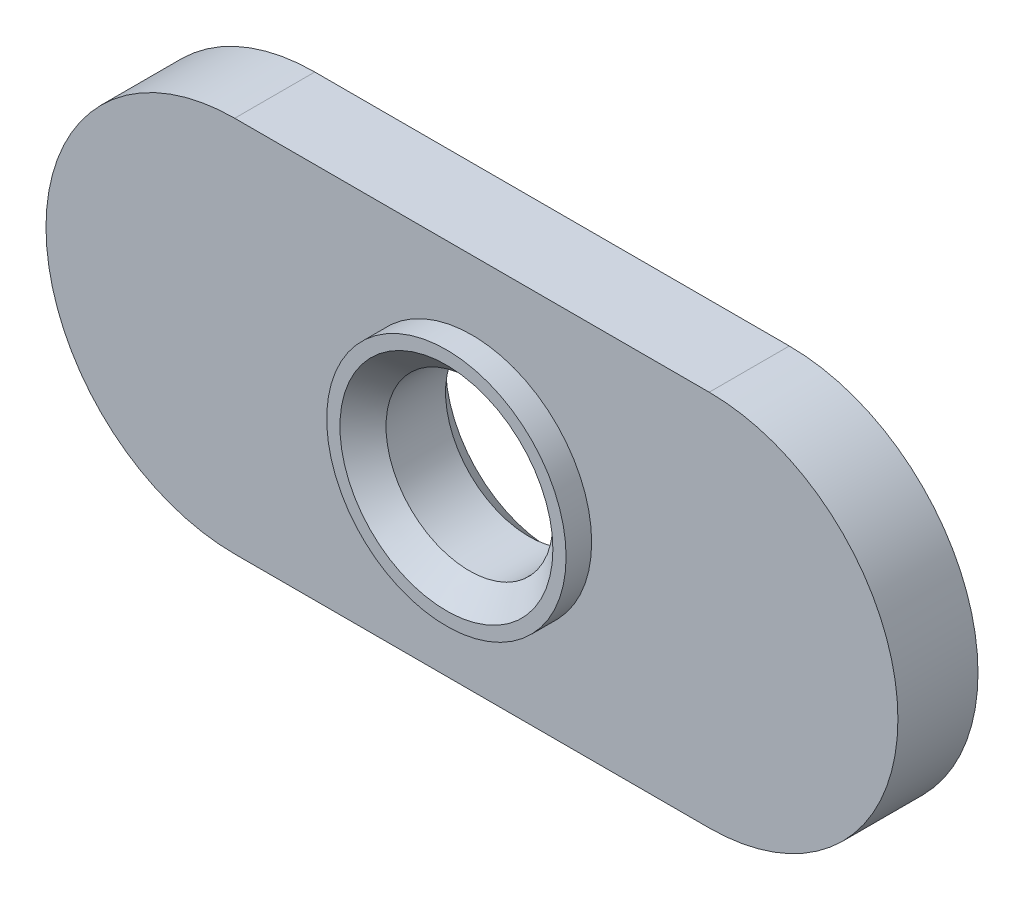
ISO-10303-21;
HEADER;
FILE_DESCRIPTION(('STEP AP214'),'2;1');
FILE_NAME('part.step','',(''),(''),'','','');
FILE_SCHEMA(('AUTOMOTIVE_DESIGN { 1 0 10303 214 1 1 1 1 }'));
ENDSEC;
DATA;
#1=APPLICATION_CONTEXT('core data for automotive mechanical design processes');
#2=APPLICATION_PROTOCOL_DEFINITION('international standard','automotive_design',2000,#1);
#3=PRODUCT_CONTEXT('',#1,'mechanical');
#4=PRODUCT('Part','Part','',(#3));
#5=PRODUCT_RELATED_PRODUCT_CATEGORY('part','',(#4));
#6=PRODUCT_DEFINITION_FORMATION('','',#4);
#7=PRODUCT_DEFINITION_CONTEXT('part definition',#1,'design');
#8=PRODUCT_DEFINITION('design','',#6,#7);
#9=PRODUCT_DEFINITION_SHAPE('','',#8);
#10=(LENGTH_UNIT() NAMED_UNIT(*) SI_UNIT(.MILLI.,.METRE.));
#11=(NAMED_UNIT(*) PLANE_ANGLE_UNIT() SI_UNIT($,.RADIAN.));
#12=(NAMED_UNIT(*) SI_UNIT($,.STERADIAN.) SOLID_ANGLE_UNIT());
#13=UNCERTAINTY_MEASURE_WITH_UNIT(LENGTH_MEASURE(1.E-05),#10,'distance_accuracy_value','');
#14=(GEOMETRIC_REPRESENTATION_CONTEXT(3) GLOBAL_UNCERTAINTY_ASSIGNED_CONTEXT((#13)) GLOBAL_UNIT_ASSIGNED_CONTEXT((#10,
#11,#12)) REPRESENTATION_CONTEXT('',''));
#15=CARTESIAN_POINT('',(0.,0.,0.));
#16=DIRECTION('',(0.,0.,1.));
#17=DIRECTION('',(1.,0.,0.));
#18=AXIS2_PLACEMENT_3D('',#15,#16,#17);
#19=CARTESIAN_POINT('',(-7.0739,0.,-1.1938));
#20=DIRECTION('',(0.,0.,1.));
#21=DIRECTION('',(1.,0.,0.));
#22=AXIS2_PLACEMENT_3D('',#19,#20,#21);
#23=PLANE('',#22);
#24=CARTESIAN_POINT('',(-7.0739,0.,-1.1938));
#25=DIRECTION('',(0.,0.,1.));
#26=DIRECTION('',(1.,0.,0.));
#27=AXIS2_PLACEMENT_3D('',#24,#25,#26);
#28=CIRCLE('',#27,5.6261);
#29=CARTESIAN_POINT('',(-7.0739,5.6261,-1.1938));
#30=VERTEX_POINT('',#29);
#31=CARTESIAN_POINT('',(-7.0739,-5.6261,-1.1938));
#32=VERTEX_POINT('',#31);
#33=EDGE_CURVE('E88',#30,#32,#28,.T.);
#34=ORIENTED_EDGE('',*,*,#33,.F.);
#35=DIRECTION('',(-1.,0.,0.));
#36=VECTOR('',#35,1.);
#37=CARTESIAN_POINT('',(7.0739,5.6261,-1.1938));
#38=LINE('',#37,#36);
#39=CARTESIAN_POINT('',(7.0739,5.6261,-1.1938));
#40=VERTEX_POINT('',#39);
#41=EDGE_CURVE('E101',#40,#30,#38,.T.);
#42=ORIENTED_EDGE('',*,*,#41,.F.);
#43=CARTESIAN_POINT('',(7.0739,0.,-1.1938));
#44=DIRECTION('',(0.,0.,1.));
#45=DIRECTION('',(1.,0.,0.));
#46=AXIS2_PLACEMENT_3D('',#43,#44,#45);
#47=CIRCLE('',#46,5.6261);
#48=CARTESIAN_POINT('',(7.0739,-5.6261,-1.1938));
#49=VERTEX_POINT('',#48);
#50=EDGE_CURVE('E91',#49,#40,#47,.T.);
#51=ORIENTED_EDGE('',*,*,#50,.F.);
#52=DIRECTION('',(1.,0.,0.));
#53=VECTOR('',#52,1.);
#54=CARTESIAN_POINT('',(-7.0739,-5.6261,-1.1938));
#55=LINE('',#54,#53);
#56=EDGE_CURVE('E78',#32,#49,#55,.T.);
#57=ORIENTED_EDGE('',*,*,#56,.F.);
#58=EDGE_LOOP('',(#34,#42,#51,#57));
#59=FACE_BOUND('',#58,.T.);
#60=CARTESIAN_POINT('',(0.,0.,-1.1938));
#61=DIRECTION('',(0.,0.,1.));
#62=DIRECTION('',(1.,0.,0.));
#63=AXIS2_PLACEMENT_3D('',#60,#61,#62);
#64=CIRCLE('',#63,3.175);
#65=CARTESIAN_POINT('',(3.175,0.,-1.1938));
#66=VERTEX_POINT('',#65);
#67=EDGE_CURVE('E141',#66,#66,#64,.T.);
#68=ORIENTED_EDGE('',*,*,#67,.T.);
#69=EDGE_LOOP('',(#68));
#70=FACE_BOUND('',#69,.T.);
#71=ADVANCED_FACE('F34',(#59,#70),#23,.F.);
#72=CARTESIAN_POINT('',(0.,0.,1.9558));
#73=DIRECTION('',(0.,0.,1.));
#74=DIRECTION('',(1.,0.,0.));
#75=AXIS2_PLACEMENT_3D('',#72,#73,#74);
#76=PLANE('',#75);
#77=CARTESIAN_POINT('',(0.,0.,1.9558));
#78=DIRECTION('',(0.,0.,1.));
#79=DIRECTION('',(1.,0.,0.));
#80=AXIS2_PLACEMENT_3D('',#77,#78,#79);
#81=CIRCLE('',#80,3.5687);
#82=CARTESIAN_POINT('',(3.5687,0.,1.9558));
#83=VERTEX_POINT('',#82);
#84=EDGE_CURVE('E96',#83,#83,#81,.T.);
#85=ORIENTED_EDGE('',*,*,#84,.T.);
#86=EDGE_LOOP('',(#85));
#87=FACE_BOUND('',#86,.T.);
#88=CARTESIAN_POINT('',(0.,0.,1.9558));
#89=DIRECTION('',(0.,0.,1.));
#90=DIRECTION('',(1.,0.,0.));
#91=AXIS2_PLACEMENT_3D('',#88,#89,#90);
#92=CIRCLE('',#91,3.175);
#93=CARTESIAN_POINT('',(3.175,0.,1.9558));
#94=VERTEX_POINT('',#93);
#95=EDGE_CURVE('E130',#94,#94,#92,.T.);
#96=ORIENTED_EDGE('',*,*,#95,.F.);
#97=EDGE_LOOP('',(#96));
#98=FACE_BOUND('',#97,.T.);
#99=ADVANCED_FACE('F118',(#87,#98),#76,.T.);
#100=CARTESIAN_POINT('',(-7.0739,0.,1.1938));
#101=DIRECTION('',(0.,0.,1.));
#102=DIRECTION('',(1.,0.,0.));
#103=AXIS2_PLACEMENT_3D('',#100,#101,#102);
#104=PLANE('',#103);
#105=CARTESIAN_POINT('',(-7.0739,0.,1.1938));
#106=DIRECTION('',(0.,0.,1.));
#107=DIRECTION('',(1.,0.,0.));
#108=AXIS2_PLACEMENT_3D('',#105,#106,#107);
#109=CIRCLE('',#108,5.6261);
#110=CARTESIAN_POINT('',(-7.0739,5.6261,1.1938));
#111=VERTEX_POINT('',#110);
#112=CARTESIAN_POINT('',(-7.0739,-5.6261,1.1938));
#113=VERTEX_POINT('',#112);
#114=EDGE_CURVE('E103',#111,#113,#109,.T.);
#115=ORIENTED_EDGE('',*,*,#114,.T.);
#116=DIRECTION('',(1.,0.,0.));
#117=VECTOR('',#116,1.);
#118=CARTESIAN_POINT('',(-7.0739,-5.6261,1.1938));
#119=LINE('',#118,#117);
#120=CARTESIAN_POINT('',(7.0739,-5.6261,1.1938));
#121=VERTEX_POINT('',#120);
#122=EDGE_CURVE('E79',#113,#121,#119,.T.);
#123=ORIENTED_EDGE('',*,*,#122,.T.);
#124=CARTESIAN_POINT('',(7.0739,0.,1.1938));
#125=DIRECTION('',(0.,0.,1.));
#126=DIRECTION('',(1.,0.,0.));
#127=AXIS2_PLACEMENT_3D('',#124,#125,#126);
#128=CIRCLE('',#127,5.6261);
#129=CARTESIAN_POINT('',(7.0739,5.6261,1.1938));
#130=VERTEX_POINT('',#129);
#131=EDGE_CURVE('E55',#121,#130,#128,.T.);
#132=ORIENTED_EDGE('',*,*,#131,.T.);
#133=DIRECTION('',(-1.,0.,0.));
#134=VECTOR('',#133,1.);
#135=CARTESIAN_POINT('',(7.0739,5.6261,1.1938));
#136=LINE('',#135,#134);
#137=EDGE_CURVE('E50',#130,#111,#136,.T.);
#138=ORIENTED_EDGE('',*,*,#137,.T.);
#139=EDGE_LOOP('',(#115,#123,#132,#138));
#140=FACE_BOUND('',#139,.T.);
#141=CARTESIAN_POINT('',(0.,0.,1.1938));
#142=DIRECTION('',(0.,0.,1.));
#143=DIRECTION('',(1.,0.,0.));
#144=AXIS2_PLACEMENT_3D('',#141,#142,#143);
#145=CIRCLE('',#144,3.5687);
#146=CARTESIAN_POINT('',(3.5687,0.,1.1938));
#147=VERTEX_POINT('',#146);
#148=EDGE_CURVE('E38',#147,#147,#145,.F.);
#149=ORIENTED_EDGE('',*,*,#148,.T.);
#150=EDGE_LOOP('',(#149));
#151=FACE_BOUND('',#150,.T.);
#152=ADVANCED_FACE('F115',(#140,#151),#104,.T.);
#153=CARTESIAN_POINT('',(-7.0739,0.,1.1938));
#154=DIRECTION('',(0.,0.,-1.));
#155=DIRECTION('',(-1.,0.,0.));
#156=AXIS2_PLACEMENT_3D('',#153,#154,#155);
#157=CYLINDRICAL_SURFACE('',#156,5.6261);
#158=DIRECTION('',(0.,0.,-1.));
#159=VECTOR('',#158,1.);
#160=CARTESIAN_POINT('',(-7.0739,5.6261,1.1938));
#161=LINE('',#160,#159);
#162=EDGE_CURVE('E93',#111,#30,#161,.T.);
#163=ORIENTED_EDGE('',*,*,#162,.T.);
#164=ORIENTED_EDGE('',*,*,#33,.T.);
#165=DIRECTION('',(0.,0.,-1.));
#166=VECTOR('',#165,1.);
#167=CARTESIAN_POINT('',(-7.0739,-5.6261,1.1938));
#168=LINE('',#167,#166);
#169=EDGE_CURVE('E11',#113,#32,#168,.T.);
#170=ORIENTED_EDGE('',*,*,#169,.F.);
#171=ORIENTED_EDGE('',*,*,#114,.F.);
#172=EDGE_LOOP('',(#163,#164,#170,#171));
#173=FACE_BOUND('',#172,.T.);
#174=ADVANCED_FACE('F36',(#173),#157,.T.);
#175=CARTESIAN_POINT('',(-7.0739,-5.6261,1.1938));
#176=DIRECTION('',(0.,1.,0.));
#177=DIRECTION('',(0.,0.,1.));
#178=AXIS2_PLACEMENT_3D('',#175,#176,#177);
#179=PLANE('',#178);
#180=ORIENTED_EDGE('',*,*,#169,.T.);
#181=ORIENTED_EDGE('',*,*,#56,.T.);
#182=DIRECTION('',(0.,0.,-1.));
#183=VECTOR('',#182,1.);
#184=CARTESIAN_POINT('',(7.0739,-5.6261,1.1938));
#185=LINE('',#184,#183);
#186=EDGE_CURVE('E43',#121,#49,#185,.T.);
#187=ORIENTED_EDGE('',*,*,#186,.F.);
#188=ORIENTED_EDGE('',*,*,#122,.F.);
#189=EDGE_LOOP('',(#180,#181,#187,#188));
#190=FACE_BOUND('',#189,.T.);
#191=ADVANCED_FACE('F76',(#190),#179,.F.);
#192=CARTESIAN_POINT('',(7.0739,0.,1.1938));
#193=DIRECTION('',(0.,0.,-1.));
#194=DIRECTION('',(-1.,0.,0.));
#195=AXIS2_PLACEMENT_3D('',#192,#193,#194);
#196=CYLINDRICAL_SURFACE('',#195,5.6261);
#197=ORIENTED_EDGE('',*,*,#186,.T.);
#198=ORIENTED_EDGE('',*,*,#50,.T.);
#199=DIRECTION('',(0.,0.,-1.));
#200=VECTOR('',#199,1.);
#201=CARTESIAN_POINT('',(7.0739,5.6261,1.1938));
#202=LINE('',#201,#200);
#203=EDGE_CURVE('E109',#130,#40,#202,.T.);
#204=ORIENTED_EDGE('',*,*,#203,.F.);
#205=ORIENTED_EDGE('',*,*,#131,.F.);
#206=EDGE_LOOP('',(#197,#198,#204,#205));
#207=FACE_BOUND('',#206,.T.);
#208=ADVANCED_FACE('F112',(#207),#196,.T.);
#209=CARTESIAN_POINT('',(7.0739,5.6261,1.1938));
#210=DIRECTION('',(0.,-1.,0.));
#211=DIRECTION('',(0.,0.,-1.));
#212=AXIS2_PLACEMENT_3D('',#209,#210,#211);
#213=PLANE('',#212);
#214=ORIENTED_EDGE('',*,*,#203,.T.);
#215=ORIENTED_EDGE('',*,*,#41,.T.);
#216=ORIENTED_EDGE('',*,*,#162,.F.);
#217=ORIENTED_EDGE('',*,*,#137,.F.);
#218=EDGE_LOOP('',(#214,#215,#216,#217));
#219=FACE_BOUND('',#218,.T.);
#220=ADVANCED_FACE('F114',(#219),#213,.F.);
#221=CARTESIAN_POINT('',(0.,0.,1.9558));
#222=DIRECTION('',(0.,0.,-1.));
#223=DIRECTION('',(-1.,0.,0.));
#224=AXIS2_PLACEMENT_3D('',#221,#222,#223);
#225=CYLINDRICAL_SURFACE('',#224,3.5687);
#226=ORIENTED_EDGE('',*,*,#148,.F.);
#227=EDGE_LOOP('',(#226));
#228=FACE_BOUND('',#227,.T.);
#229=ORIENTED_EDGE('',*,*,#84,.F.);
#230=EDGE_LOOP('',(#229));
#231=FACE_BOUND('',#230,.T.);
#232=ADVANCED_FACE('F122',(#228,#231),#225,.T.);
#233=CARTESIAN_POINT('',(0.,0.,1.26873));
#234=DIRECTION('',(0.,0.,1.));
#235=DIRECTION('',(1.,0.,0.));
#236=AXIS2_PLACEMENT_3D('',#233,#234,#235);
#237=CONICAL_SURFACE('',#236,2.48793,0.785398163397448);
#238=ORIENTED_EDGE('',*,*,#95,.T.);
#239=EDGE_LOOP('',(#238));
#240=FACE_BOUND('',#239,.T.);
#241=CARTESIAN_POINT('',(0.,0.,1.26873));
#242=DIRECTION('',(0.,0.,1.));
#243=DIRECTION('',(1.,0.,0.));
#244=AXIS2_PLACEMENT_3D('',#241,#242,#243);
#245=CIRCLE('',#244,2.48793);
#246=CARTESIAN_POINT('',(2.48793,0.,1.26873));
#247=VERTEX_POINT('',#246);
#248=EDGE_CURVE('E132',#247,#247,#245,.T.);
#249=ORIENTED_EDGE('',*,*,#248,.F.);
#250=EDGE_LOOP('',(#249));
#251=FACE_BOUND('',#250,.T.);
#252=ADVANCED_FACE('F125',(#240,#251),#237,.F.);
#253=CARTESIAN_POINT('',(0.,0.,-1.1938));
#254=DIRECTION('',(0.,0.,1.));
#255=DIRECTION('',(1.,0.,0.));
#256=AXIS2_PLACEMENT_3D('',#253,#254,#255);
#257=CYLINDRICAL_SURFACE('',#256,2.48793);
#258=ORIENTED_EDGE('',*,*,#248,.T.);
#259=EDGE_LOOP('',(#258));
#260=FACE_BOUND('',#259,.T.);
#261=CARTESIAN_POINT('',(0.,0.,-0.50673));
#262=DIRECTION('',(0.,0.,1.));
#263=DIRECTION('',(1.,0.,0.));
#264=AXIS2_PLACEMENT_3D('',#261,#262,#263);
#265=CIRCLE('',#264,2.48793);
#266=CARTESIAN_POINT('',(2.48793,0.,-0.50673));
#267=VERTEX_POINT('',#266);
#268=EDGE_CURVE('E136',#267,#267,#265,.T.);
#269=ORIENTED_EDGE('',*,*,#268,.F.);
#270=EDGE_LOOP('',(#269));
#271=FACE_BOUND('',#270,.T.);
#272=ADVANCED_FACE('F147',(#260,#271),#257,.F.);
#273=CARTESIAN_POINT('',(0.,0.,-1.1938));
#274=DIRECTION('',(0.,0.,-1.));
#275=DIRECTION('',(-1.,0.,0.));
#276=AXIS2_PLACEMENT_3D('',#273,#274,#275);
#277=CONICAL_SURFACE('',#276,3.175,0.785398163397448);
#278=ORIENTED_EDGE('',*,*,#268,.T.);
#279=EDGE_LOOP('',(#278));
#280=FACE_BOUND('',#279,.T.);
#281=ORIENTED_EDGE('',*,*,#67,.F.);
#282=EDGE_LOOP('',(#281));
#283=FACE_BOUND('',#282,.T.);
#284=ADVANCED_FACE('F145',(#280,#283),#277,.F.);
#285=CLOSED_SHELL('',(#71,#99,#152,#174,#191,#208,#220,#232,#252,#272,#284));
#286=MANIFOLD_SOLID_BREP('B2',#285);
#287=ADVANCED_BREP_SHAPE_REPRESENTATION('',(#18,#286),#14);
#288=SHAPE_DEFINITION_REPRESENTATION(#9,#287);
ENDSEC;
END-ISO-10303-21;
